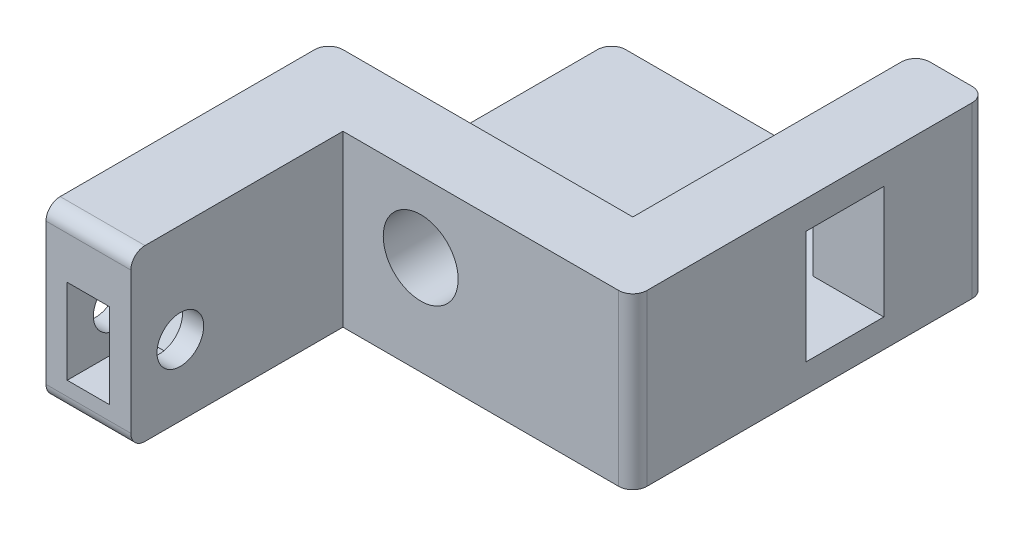
ISO-10303-21;
HEADER;
FILE_DESCRIPTION(('STEP AP214'),'2;1');
FILE_NAME('part.step','',(''),(''),'','','');
FILE_SCHEMA(('AUTOMOTIVE_DESIGN { 1 0 10303 214 1 1 1 1 }'));
ENDSEC;
DATA;
#1=APPLICATION_CONTEXT('core data for automotive mechanical design processes');
#2=APPLICATION_PROTOCOL_DEFINITION('international standard','automotive_design',2000,#1);
#3=PRODUCT_CONTEXT('',#1,'mechanical');
#4=PRODUCT('Part','Part','',(#3));
#5=PRODUCT_RELATED_PRODUCT_CATEGORY('part','',(#4));
#6=PRODUCT_DEFINITION_FORMATION('','',#4);
#7=PRODUCT_DEFINITION_CONTEXT('part definition',#1,'design');
#8=PRODUCT_DEFINITION('design','',#6,#7);
#9=PRODUCT_DEFINITION_SHAPE('','',#8);
#10=(LENGTH_UNIT() NAMED_UNIT(*) SI_UNIT(.MILLI.,.METRE.));
#11=(NAMED_UNIT(*) PLANE_ANGLE_UNIT() SI_UNIT($,.RADIAN.));
#12=(NAMED_UNIT(*) SI_UNIT($,.STERADIAN.) SOLID_ANGLE_UNIT());
#13=UNCERTAINTY_MEASURE_WITH_UNIT(LENGTH_MEASURE(1.E-05),#10,'distance_accuracy_value','');
#14=(GEOMETRIC_REPRESENTATION_CONTEXT(3) GLOBAL_UNCERTAINTY_ASSIGNED_CONTEXT((#13)) GLOBAL_UNIT_ASSIGNED_CONTEXT((#10,
#11,#12)) REPRESENTATION_CONTEXT('',''));
#15=CARTESIAN_POINT('',(0.,0.,0.));
#16=DIRECTION('',(0.,0.,1.));
#17=DIRECTION('',(1.,0.,0.));
#18=AXIS2_PLACEMENT_3D('',#15,#16,#17);
#19=CARTESIAN_POINT('',(0.,10.,60.));
#20=DIRECTION('',(0.,0.,1.));
#21=DIRECTION('',(-1.,0.,0.));
#22=AXIS2_PLACEMENT_3D('',#19,#20,#21);
#23=PLANE('',#22);
#24=DIRECTION('',(0.,-1.,0.));
#25=VECTOR('',#24,1.);
#26=CARTESIAN_POINT('',(6.,10.,60.));
#27=LINE('',#26,#25);
#28=CARTESIAN_POINT('',(6.,9.,60.));
#29=VERTEX_POINT('',#28);
#30=CARTESIAN_POINT('',(6.,-0.999999999999999,60.));
#31=VERTEX_POINT('',#30);
#32=EDGE_CURVE('E338',#29,#31,#27,.T.);
#33=ORIENTED_EDGE('',*,*,#32,.F.);
#34=DIRECTION('',(1.,0.,0.));
#35=VECTOR('',#34,1.);
#36=CARTESIAN_POINT('',(6.,9.,60.));
#37=LINE('',#36,#35);
#38=CARTESIAN_POINT('',(0.,9.,60.));
#39=VERTEX_POINT('',#38);
#40=EDGE_CURVE('E416',#39,#29,#37,.T.);
#41=ORIENTED_EDGE('',*,*,#40,.F.);
#42=DIRECTION('',(0.,-1.,0.));
#43=VECTOR('',#42,1.);
#44=CARTESIAN_POINT('',(0.,10.,60.));
#45=LINE('',#44,#43);
#46=CARTESIAN_POINT('',(0.,-0.999999999999999,60.));
#47=VERTEX_POINT('',#46);
#48=EDGE_CURVE('E325',#39,#47,#45,.T.);
#49=ORIENTED_EDGE('',*,*,#48,.T.);
#50=DIRECTION('',(1.,0.,0.));
#51=VECTOR('',#50,1.);
#52=CARTESIAN_POINT('',(0.,-0.999999999999999,60.));
#53=LINE('',#52,#51);
#54=EDGE_CURVE('E418',#31,#47,#53,.F.);
#55=ORIENTED_EDGE('',*,*,#54,.F.);
#56=EDGE_LOOP('',(#33,#41,#49,#55));
#57=FACE_BOUND('',#56,.T.);
#58=DIRECTION('',(-1.,0.,0.));
#59=VECTOR('',#58,1.);
#60=CARTESIAN_POINT('',(4.5,0.,60.));
#61=LINE('',#60,#59);
#62=CARTESIAN_POINT('',(4.5,0.,60.));
#63=VERTEX_POINT('',#62);
#64=CARTESIAN_POINT('',(1.5,0.,60.));
#65=VERTEX_POINT('',#64);
#66=EDGE_CURVE('E229',#63,#65,#61,.T.);
#67=ORIENTED_EDGE('',*,*,#66,.T.);
#68=DIRECTION('',(0.,1.,0.));
#69=VECTOR('',#68,1.);
#70=CARTESIAN_POINT('',(1.5,0.,60.));
#71=LINE('',#70,#69);
#72=CARTESIAN_POINT('',(1.5,6.,60.));
#73=VERTEX_POINT('',#72);
#74=EDGE_CURVE('E232',#65,#73,#71,.T.);
#75=ORIENTED_EDGE('',*,*,#74,.T.);
#76=DIRECTION('',(-1.,0.,0.));
#77=VECTOR('',#76,1.);
#78=CARTESIAN_POINT('',(4.5,6.,60.));
#79=LINE('',#78,#77);
#80=CARTESIAN_POINT('',(4.5,6.,60.));
#81=VERTEX_POINT('',#80);
#82=EDGE_CURVE('E250',#81,#73,#79,.T.);
#83=ORIENTED_EDGE('',*,*,#82,.F.);
#84=DIRECTION('',(0.,1.,0.));
#85=VECTOR('',#84,1.);
#86=CARTESIAN_POINT('',(4.5,0.,60.));
#87=LINE('',#86,#85);
#88=EDGE_CURVE('E214',#63,#81,#87,.T.);
#89=ORIENTED_EDGE('',*,*,#88,.F.);
#90=EDGE_LOOP('',(#67,#75,#83,#89));
#91=FACE_BOUND('',#90,.T.);
#92=ADVANCED_FACE('F34',(#57,#91),#23,.T.);
#93=CARTESIAN_POINT('',(-4.,3.,56.5));
#94=DIRECTION('',(1.,0.,0.));
#95=DIRECTION('',(0.,0.,1.));
#96=AXIS2_PLACEMENT_3D('',#93,#94,#95);
#97=CYLINDRICAL_SURFACE('',#96,1.65);
#98=CARTESIAN_POINT('',(6.,3.,56.5));
#99=DIRECTION('',(-1.,0.,0.));
#100=DIRECTION('',(0.,0.,1.));
#101=AXIS2_PLACEMENT_3D('',#98,#99,#100);
#102=CIRCLE('',#101,1.65);
#103=CARTESIAN_POINT('',(6.,3.,58.15));
#104=VERTEX_POINT('',#103);
#105=EDGE_CURVE('E263',#104,#104,#102,.T.);
#106=ORIENTED_EDGE('',*,*,#105,.F.);
#107=EDGE_LOOP('',(#106));
#108=FACE_BOUND('',#107,.T.);
#109=CARTESIAN_POINT('',(4.5,3.,56.5));
#110=DIRECTION('',(1.,0.,0.));
#111=DIRECTION('',(0.,0.,-1.));
#112=AXIS2_PLACEMENT_3D('',#109,#110,#111);
#113=CIRCLE('',#112,1.65);
#114=CARTESIAN_POINT('',(4.5,3.,54.85));
#115=VERTEX_POINT('',#114);
#116=EDGE_CURVE('E260',#115,#115,#113,.F.);
#117=ORIENTED_EDGE('',*,*,#116,.T.);
#118=EDGE_LOOP('',(#117));
#119=FACE_BOUND('',#118,.T.);
#120=ADVANCED_FACE('F481',(#108,#119),#97,.F.);
#121=CARTESIAN_POINT('',(21.5,10.,40.));
#122=DIRECTION('',(0.,0.,-1.));
#123=DIRECTION('',(1.,0.,0.));
#124=AXIS2_PLACEMENT_3D('',#121,#122,#123);
#125=PLANE('',#124);
#126=CARTESIAN_POINT('',(11.5,5.,40.));
#127=DIRECTION('',(0.,0.,1.));
#128=DIRECTION('',(1.,0.,0.));
#129=AXIS2_PLACEMENT_3D('',#126,#127,#128);
#130=CIRCLE('',#129,2.65);
#131=CARTESIAN_POINT('',(14.15,5.,40.));
#132=VERTEX_POINT('',#131);
#133=EDGE_CURVE('E259',#132,#132,#130,.T.);
#134=ORIENTED_EDGE('',*,*,#133,.T.);
#135=EDGE_LOOP('',(#134));
#136=FACE_BOUND('',#135,.T.);
#137=DIRECTION('',(-1.,0.,0.));
#138=VECTOR('',#137,1.);
#139=CARTESIAN_POINT('',(21.5,10.,40.));
#140=LINE('',#139,#138);
#141=CARTESIAN_POINT('',(21.5,10.,40.));
#142=VERTEX_POINT('',#141);
#143=CARTESIAN_POINT('',(1.,10.,40.));
#144=VERTEX_POINT('',#143);
#145=EDGE_CURVE('E305',#142,#144,#140,.T.);
#146=ORIENTED_EDGE('',*,*,#145,.F.);
#147=DIRECTION('',(0.,-1.,0.));
#148=VECTOR('',#147,1.);
#149=CARTESIAN_POINT('',(21.5,10.,40.));
#150=LINE('',#149,#148);
#151=CARTESIAN_POINT('',(21.5,0.,40.));
#152=VERTEX_POINT('',#151);
#153=EDGE_CURVE('E331',#142,#152,#150,.T.);
#154=ORIENTED_EDGE('',*,*,#153,.T.);
#155=DIRECTION('',(-1.,0.,0.));
#156=VECTOR('',#155,1.);
#157=CARTESIAN_POINT('',(21.5,0.,40.));
#158=LINE('',#157,#156);
#159=CARTESIAN_POINT('',(1.,0.,40.));
#160=VERTEX_POINT('',#159);
#161=EDGE_CURVE('E300',#152,#160,#158,.T.);
#162=ORIENTED_EDGE('',*,*,#161,.T.);
#163=DIRECTION('',(0.,-1.,0.));
#164=VECTOR('',#163,1.);
#165=CARTESIAN_POINT('',(1.,10.,40.));
#166=LINE('',#165,#164);
#167=EDGE_CURVE('E411',#144,#160,#166,.T.);
#168=ORIENTED_EDGE('',*,*,#167,.F.);
#169=EDGE_LOOP('',(#146,#154,#162,#168));
#170=FACE_BOUND('',#169,.T.);
#171=ADVANCED_FACE('F449',(#136,#170),#125,.T.);
#172=CARTESIAN_POINT('',(21.5,10.,20.));
#173=DIRECTION('',(-1.,0.,0.));
#174=DIRECTION('',(0.,0.,-1.));
#175=AXIS2_PLACEMENT_3D('',#172,#173,#174);
#176=PLANE('',#175);
#177=DIRECTION('',(0.,0.,1.));
#178=VECTOR('',#177,1.);
#179=CARTESIAN_POINT('',(21.5,0.,20.));
#180=LINE('',#179,#178);
#181=CARTESIAN_POINT('',(21.5,0.,21.));
#182=VERTEX_POINT('',#181);
#183=CARTESIAN_POINT('',(21.5,0.,27.25));
#184=VERTEX_POINT('',#183);
#185=EDGE_CURVE('E309',#182,#184,#180,.T.);
#186=ORIENTED_EDGE('',*,*,#185,.T.);
#187=DIRECTION('',(0.,1.,0.));
#188=VECTOR('',#187,1.);
#189=CARTESIAN_POINT('',(21.5,0.,27.25));
#190=LINE('',#189,#188);
#191=CARTESIAN_POINT('',(21.5,8.,27.25));
#192=VERTEX_POINT('',#191);
#193=EDGE_CURVE('E270',#184,#192,#190,.T.);
#194=ORIENTED_EDGE('',*,*,#193,.T.);
#195=DIRECTION('',(0.,0.,1.));
#196=VECTOR('',#195,1.);
#197=CARTESIAN_POINT('',(21.5,8.,32.75));
#198=LINE('',#197,#196);
#199=CARTESIAN_POINT('',(21.5,8.,32.75));
#200=VERTEX_POINT('',#199);
#201=EDGE_CURVE('E273',#192,#200,#198,.T.);
#202=ORIENTED_EDGE('',*,*,#201,.T.);
#203=DIRECTION('',(0.,-1.,0.));
#204=VECTOR('',#203,1.);
#205=CARTESIAN_POINT('',(21.5,0.,32.75));
#206=LINE('',#205,#204);
#207=CARTESIAN_POINT('',(21.5,0.,32.75));
#208=VERTEX_POINT('',#207);
#209=EDGE_CURVE('E267',#200,#208,#206,.T.);
#210=ORIENTED_EDGE('',*,*,#209,.T.);
#211=EDGE_CURVE('E328',#208,#152,#180,.T.);
#212=ORIENTED_EDGE('',*,*,#211,.T.);
#213=ORIENTED_EDGE('',*,*,#153,.F.);
#214=DIRECTION('',(0.,0.,1.));
#215=VECTOR('',#214,1.);
#216=CARTESIAN_POINT('',(21.5,10.,20.));
#217=LINE('',#216,#215);
#218=CARTESIAN_POINT('',(21.5,10.,21.));
#219=VERTEX_POINT('',#218);
#220=EDGE_CURVE('E323',#219,#142,#217,.T.);
#221=ORIENTED_EDGE('',*,*,#220,.F.);
#222=DIRECTION('',(0.,-1.,0.));
#223=VECTOR('',#222,1.);
#224=CARTESIAN_POINT('',(21.5,10.,21.));
#225=LINE('',#224,#223);
#226=EDGE_CURVE('E389',#182,#219,#225,.F.);
#227=ORIENTED_EDGE('',*,*,#226,.F.);
#228=EDGE_LOOP('',(#186,#194,#202,#210,#212,#213,#221,#227));
#229=FACE_BOUND('',#228,.T.);
#230=ADVANCED_FACE('F428',(#229),#176,.T.);
#231=CARTESIAN_POINT('',(26.5,10.,20.));
#232=DIRECTION('',(0.,0.,-1.));
#233=DIRECTION('',(1.,0.,0.));
#234=AXIS2_PLACEMENT_3D('',#231,#232,#233);
#235=PLANE('',#234);
#236=DIRECTION('',(-1.,0.,0.));
#237=VECTOR('',#236,1.);
#238=CARTESIAN_POINT('',(26.5,0.,20.));
#239=LINE('',#238,#237);
#240=CARTESIAN_POINT('',(22.5,0.,20.));
#241=VERTEX_POINT('',#240);
#242=CARTESIAN_POINT('',(1.,0.,20.));
#243=VERTEX_POINT('',#242);
#244=EDGE_CURVE('E279',#241,#243,#239,.T.);
#245=ORIENTED_EDGE('',*,*,#244,.F.);
#246=DIRECTION('',(0.,-1.,0.));
#247=VECTOR('',#246,1.);
#248=CARTESIAN_POINT('',(22.5,10.,20.));
#249=LINE('',#248,#247);
#250=CARTESIAN_POINT('',(22.5,10.,20.));
#251=VERTEX_POINT('',#250);
#252=EDGE_CURVE('E375',#251,#241,#249,.T.);
#253=ORIENTED_EDGE('',*,*,#252,.F.);
#254=DIRECTION('',(-1.,0.,0.));
#255=VECTOR('',#254,1.);
#256=CARTESIAN_POINT('',(26.5,10.,20.));
#257=LINE('',#256,#255);
#258=CARTESIAN_POINT('',(25.5,10.,20.));
#259=VERTEX_POINT('',#258);
#260=EDGE_CURVE('E320',#259,#251,#257,.T.);
#261=ORIENTED_EDGE('',*,*,#260,.F.);
#262=DIRECTION('',(0.,-1.,0.));
#263=VECTOR('',#262,1.);
#264=CARTESIAN_POINT('',(25.5,10.,20.));
#265=LINE('',#264,#263);
#266=CARTESIAN_POINT('',(25.5,-2.,20.));
#267=VERTEX_POINT('',#266);
#268=EDGE_CURVE('E372',#267,#259,#265,.F.);
#269=ORIENTED_EDGE('',*,*,#268,.F.);
#270=DIRECTION('',(-1.,0.,0.));
#271=VECTOR('',#270,1.);
#272=CARTESIAN_POINT('',(26.5,-2.,20.));
#273=LINE('',#272,#271);
#274=CARTESIAN_POINT('',(1.,-2.,20.));
#275=VERTEX_POINT('',#274);
#276=EDGE_CURVE('E288',#267,#275,#273,.T.);
#277=ORIENTED_EDGE('',*,*,#276,.T.);
#278=DIRECTION('',(0.,1.,0.));
#279=VECTOR('',#278,1.);
#280=CARTESIAN_POINT('',(1.,10.,20.));
#281=LINE('',#280,#279);
#282=EDGE_CURVE('E378',#243,#275,#281,.F.);
#283=ORIENTED_EDGE('',*,*,#282,.F.);
#284=EDGE_LOOP('',(#245,#253,#261,#269,#277,#283));
#285=FACE_BOUND('',#284,.T.);
#286=ADVANCED_FACE('F455',(#285),#235,.T.);
#287=CARTESIAN_POINT('',(26.5,10.,45.));
#288=DIRECTION('',(1.,0.,0.));
#289=DIRECTION('',(0.,0.,1.));
#290=AXIS2_PLACEMENT_3D('',#287,#288,#289);
#291=PLANE('',#290);
#292=DIRECTION('',(0.,1.,0.));
#293=VECTOR('',#292,1.);
#294=CARTESIAN_POINT('',(26.5,10.,32.75));
#295=LINE('',#294,#293);
#296=CARTESIAN_POINT('',(26.5,0.,32.75));
#297=VERTEX_POINT('',#296);
#298=CARTESIAN_POINT('',(26.5,8.,32.75));
#299=VERTEX_POINT('',#298);
#300=EDGE_CURVE('E350',#297,#299,#295,.T.);
#301=ORIENTED_EDGE('',*,*,#300,.T.);
#302=DIRECTION('',(0.,0.,-1.));
#303=VECTOR('',#302,1.);
#304=CARTESIAN_POINT('',(26.5,8.,45.));
#305=LINE('',#304,#303);
#306=CARTESIAN_POINT('',(26.5,8.,27.25));
#307=VERTEX_POINT('',#306);
#308=EDGE_CURVE('E347',#299,#307,#305,.T.);
#309=ORIENTED_EDGE('',*,*,#308,.T.);
#310=DIRECTION('',(0.,-1.,0.));
#311=VECTOR('',#310,1.);
#312=CARTESIAN_POINT('',(26.5,10.,27.25));
#313=LINE('',#312,#311);
#314=CARTESIAN_POINT('',(26.5,0.,27.25));
#315=VERTEX_POINT('',#314);
#316=EDGE_CURVE('E344',#307,#315,#313,.T.);
#317=ORIENTED_EDGE('',*,*,#316,.T.);
#318=DIRECTION('',(0.,0.,1.));
#319=VECTOR('',#318,1.);
#320=CARTESIAN_POINT('',(26.5,0.,45.));
#321=LINE('',#320,#319);
#322=EDGE_CURVE('E334',#315,#297,#321,.T.);
#323=ORIENTED_EDGE('',*,*,#322,.T.);
#324=EDGE_LOOP('',(#301,#309,#317,#323));
#325=FACE_BOUND('',#324,.T.);
#326=DIRECTION('',(0.,0.,-1.));
#327=VECTOR('',#326,1.);
#328=CARTESIAN_POINT('',(26.5,10.,45.));
#329=LINE('',#328,#327);
#330=CARTESIAN_POINT('',(26.5,10.,44.));
#331=VERTEX_POINT('',#330);
#332=CARTESIAN_POINT('',(26.5,10.,21.));
#333=VERTEX_POINT('',#332);
#334=EDGE_CURVE('E317',#331,#333,#329,.T.);
#335=ORIENTED_EDGE('',*,*,#334,.F.);
#336=DIRECTION('',(0.,-1.,0.));
#337=VECTOR('',#336,1.);
#338=CARTESIAN_POINT('',(26.5,10.,44.));
#339=LINE('',#338,#337);
#340=CARTESIAN_POINT('',(26.5,-2.,44.));
#341=VERTEX_POINT('',#340);
#342=EDGE_CURVE('E402',#341,#331,#339,.F.);
#343=ORIENTED_EDGE('',*,*,#342,.F.);
#344=DIRECTION('',(0.,0.,-1.));
#345=VECTOR('',#344,1.);
#346=CARTESIAN_POINT('',(26.5,-2.,45.));
#347=LINE('',#346,#345);
#348=CARTESIAN_POINT('',(26.5,-2.,21.));
#349=VERTEX_POINT('',#348);
#350=EDGE_CURVE('E285',#341,#349,#347,.T.);
#351=ORIENTED_EDGE('',*,*,#350,.T.);
#352=DIRECTION('',(0.,-1.,0.));
#353=VECTOR('',#352,1.);
#354=CARTESIAN_POINT('',(26.5,10.,21.));
#355=LINE('',#354,#353);
#356=EDGE_CURVE('E405',#333,#349,#355,.T.);
#357=ORIENTED_EDGE('',*,*,#356,.F.);
#358=EDGE_LOOP('',(#335,#343,#351,#357));
#359=FACE_BOUND('',#358,.T.);
#360=ADVANCED_FACE('F513',(#325,#359),#291,.T.);
#361=CARTESIAN_POINT('',(6.,10.,45.));
#362=DIRECTION('',(0.,0.,1.));
#363=DIRECTION('',(-1.,0.,0.));
#364=AXIS2_PLACEMENT_3D('',#361,#362,#363);
#365=PLANE('',#364);
#366=CARTESIAN_POINT('',(11.5,5.,45.));
#367=DIRECTION('',(0.,0.,-1.));
#368=DIRECTION('',(-1.,0.,0.));
#369=AXIS2_PLACEMENT_3D('',#366,#367,#368);
#370=CIRCLE('',#369,2.65);
#371=CARTESIAN_POINT('',(8.85,5.,45.));
#372=VERTEX_POINT('',#371);
#373=EDGE_CURVE('E256',#372,#372,#370,.T.);
#374=ORIENTED_EDGE('',*,*,#373,.T.);
#375=EDGE_LOOP('',(#374));
#376=FACE_BOUND('',#375,.T.);
#377=DIRECTION('',(1.,0.,0.));
#378=VECTOR('',#377,1.);
#379=CARTESIAN_POINT('',(6.,10.,45.));
#380=LINE('',#379,#378);
#381=CARTESIAN_POINT('',(6.,10.,45.));
#382=VERTEX_POINT('',#381);
#383=CARTESIAN_POINT('',(25.5,10.,45.));
#384=VERTEX_POINT('',#383);
#385=EDGE_CURVE('E314',#382,#384,#380,.T.);
#386=ORIENTED_EDGE('',*,*,#385,.F.);
#387=DIRECTION('',(0.,-1.,0.));
#388=VECTOR('',#387,1.);
#389=CARTESIAN_POINT('',(6.,10.,45.));
#390=LINE('',#389,#388);
#391=CARTESIAN_POINT('',(6.,-2.,45.));
#392=VERTEX_POINT('',#391);
#393=EDGE_CURVE('E335',#382,#392,#390,.T.);
#394=ORIENTED_EDGE('',*,*,#393,.T.);
#395=DIRECTION('',(1.,0.,0.));
#396=VECTOR('',#395,1.);
#397=CARTESIAN_POINT('',(26.5,-2.,45.));
#398=LINE('',#397,#396);
#399=CARTESIAN_POINT('',(25.5,-2.,45.));
#400=VERTEX_POINT('',#399);
#401=EDGE_CURVE('E297',#392,#400,#398,.T.);
#402=ORIENTED_EDGE('',*,*,#401,.T.);
#403=DIRECTION('',(0.,-1.,0.));
#404=VECTOR('',#403,1.);
#405=CARTESIAN_POINT('',(25.5,10.,45.));
#406=LINE('',#405,#404);
#407=EDGE_CURVE('E408',#384,#400,#406,.T.);
#408=ORIENTED_EDGE('',*,*,#407,.F.);
#409=EDGE_LOOP('',(#386,#394,#402,#408));
#410=FACE_BOUND('',#409,.T.);
#411=ADVANCED_FACE('F528',(#376,#410),#365,.T.);
#412=CARTESIAN_POINT('',(6.,10.,60.));
#413=DIRECTION('',(1.,0.,0.));
#414=DIRECTION('',(0.,0.,1.));
#415=AXIS2_PLACEMENT_3D('',#412,#413,#414);
#416=PLANE('',#415);
#417=ORIENTED_EDGE('',*,*,#105,.T.);
#418=EDGE_LOOP('',(#417));
#419=FACE_BOUND('',#418,.T.);
#420=DIRECTION('',(0.,0.,-1.));
#421=VECTOR('',#420,1.);
#422=CARTESIAN_POINT('',(6.,-2.,60.));
#423=LINE('',#422,#421);
#424=CARTESIAN_POINT('',(6.,-2.,59.));
#425=VERTEX_POINT('',#424);
#426=EDGE_CURVE('E295',#425,#392,#423,.T.);
#427=ORIENTED_EDGE('',*,*,#426,.T.);
#428=ORIENTED_EDGE('',*,*,#393,.F.);
#429=DIRECTION('',(0.,0.,-1.));
#430=VECTOR('',#429,1.);
#431=CARTESIAN_POINT('',(6.,10.,60.));
#432=LINE('',#431,#430);
#433=CARTESIAN_POINT('',(6.,10.,59.));
#434=VERTEX_POINT('',#433);
#435=EDGE_CURVE('E312',#434,#382,#432,.T.);
#436=ORIENTED_EDGE('',*,*,#435,.F.);
#437=CARTESIAN_POINT('',(6.,9.,59.));
#438=DIRECTION('',(-1.,0.,0.));
#439=DIRECTION('',(0.,0.,1.));
#440=AXIS2_PLACEMENT_3D('',#437,#438,#439);
#441=CIRCLE('',#440,1.);
#442=EDGE_CURVE('E57',#29,#434,#441,.T.);
#443=ORIENTED_EDGE('',*,*,#442,.F.);
#444=ORIENTED_EDGE('',*,*,#32,.T.);
#445=CARTESIAN_POINT('',(6.,-1.,59.));
#446=DIRECTION('',(-1.,0.,0.));
#447=DIRECTION('',(0.,0.,1.));
#448=AXIS2_PLACEMENT_3D('',#445,#446,#447);
#449=CIRCLE('',#448,1.);
#450=EDGE_CURVE('E49',#425,#31,#449,.T.);
#451=ORIENTED_EDGE('',*,*,#450,.F.);
#452=EDGE_LOOP('',(#427,#428,#436,#443,#444,#451));
#453=FACE_BOUND('',#452,.T.);
#454=ADVANCED_FACE('F494',(#419,#453),#416,.T.);
#455=CARTESIAN_POINT('',(0.,10.,40.));
#456=DIRECTION('',(-1.,0.,0.));
#457=DIRECTION('',(0.,0.,-1.));
#458=AXIS2_PLACEMENT_3D('',#455,#456,#457);
#459=PLANE('',#458);
#460=CARTESIAN_POINT('',(0.,3.,56.5));
#461=DIRECTION('',(1.,0.,0.));
#462=DIRECTION('',(0.,0.,-1.));
#463=AXIS2_PLACEMENT_3D('',#460,#461,#462);
#464=CIRCLE('',#463,1.65);
#465=CARTESIAN_POINT('',(0.,3.,54.85));
#466=VERTEX_POINT('',#465);
#467=EDGE_CURVE('E266',#466,#466,#464,.T.);
#468=ORIENTED_EDGE('',*,*,#467,.T.);
#469=EDGE_LOOP('',(#468));
#470=FACE_BOUND('',#469,.T.);
#471=DIRECTION('',(0.,0.,1.));
#472=VECTOR('',#471,1.);
#473=CARTESIAN_POINT('',(0.,-2.,60.));
#474=LINE('',#473,#472);
#475=CARTESIAN_POINT('',(0.,-2.,21.));
#476=VERTEX_POINT('',#475);
#477=CARTESIAN_POINT('',(0.,-2.,59.));
#478=VERTEX_POINT('',#477);
#479=EDGE_CURVE('E292',#476,#478,#474,.T.);
#480=ORIENTED_EDGE('',*,*,#479,.T.);
#481=CARTESIAN_POINT('',(0.,-1.,59.));
#482=DIRECTION('',(1.,0.,0.));
#483=DIRECTION('',(0.,0.,-1.));
#484=AXIS2_PLACEMENT_3D('',#481,#482,#483);
#485=CIRCLE('',#484,1.);
#486=EDGE_CURVE('E361',#47,#478,#485,.T.);
#487=ORIENTED_EDGE('',*,*,#486,.F.);
#488=ORIENTED_EDGE('',*,*,#48,.F.);
#489=CARTESIAN_POINT('',(0.,9.,59.));
#490=DIRECTION('',(1.,0.,0.));
#491=DIRECTION('',(0.,0.,-1.));
#492=AXIS2_PLACEMENT_3D('',#489,#490,#491);
#493=CIRCLE('',#492,1.);
#494=CARTESIAN_POINT('',(0.,10.,59.));
#495=VERTEX_POINT('',#494);
#496=EDGE_CURVE('E353',#495,#39,#493,.T.);
#497=ORIENTED_EDGE('',*,*,#496,.F.);
#498=DIRECTION('',(0.,0.,1.));
#499=VECTOR('',#498,1.);
#500=CARTESIAN_POINT('',(0.,10.,40.));
#501=LINE('',#500,#499);
#502=CARTESIAN_POINT('',(0.,10.,41.));
#503=VERTEX_POINT('',#502);
#504=EDGE_CURVE('E308',#503,#495,#501,.T.);
#505=ORIENTED_EDGE('',*,*,#504,.F.);
#506=DIRECTION('',(0.,-1.,0.));
#507=VECTOR('',#506,1.);
#508=CARTESIAN_POINT('',(0.,10.,41.));
#509=LINE('',#508,#507);
#510=CARTESIAN_POINT('',(0.,0.,41.));
#511=VERTEX_POINT('',#510);
#512=EDGE_CURVE('E364',#511,#503,#509,.F.);
#513=ORIENTED_EDGE('',*,*,#512,.F.);
#514=DIRECTION('',(0.,0.,1.));
#515=VECTOR('',#514,1.);
#516=CARTESIAN_POINT('',(0.,0.,60.));
#517=LINE('',#516,#515);
#518=CARTESIAN_POINT('',(0.,0.,21.));
#519=VERTEX_POINT('',#518);
#520=EDGE_CURVE('E289',#519,#511,#517,.T.);
#521=ORIENTED_EDGE('',*,*,#520,.F.);
#522=DIRECTION('',(0.,1.,0.));
#523=VECTOR('',#522,1.);
#524=CARTESIAN_POINT('',(0.,10.,21.));
#525=LINE('',#524,#523);
#526=EDGE_CURVE('E367',#476,#519,#525,.T.);
#527=ORIENTED_EDGE('',*,*,#526,.F.);
#528=EDGE_LOOP('',(#480,#487,#488,#497,#505,#513,#521,#527));
#529=FACE_BOUND('',#528,.T.);
#530=ADVANCED_FACE('F464',(#470,#529),#459,.T.);
#531=CARTESIAN_POINT('',(0.,10.,40.));
#532=DIRECTION('',(0.,-1.,0.));
#533=DIRECTION('',(0.,0.,1.));
#534=AXIS2_PLACEMENT_3D('',#531,#532,#533);
#535=PLANE('',#534);
#536=ORIENTED_EDGE('',*,*,#220,.T.);
#537=ORIENTED_EDGE('',*,*,#145,.T.);
#538=CARTESIAN_POINT('',(1.,10.,41.));
#539=DIRECTION('',(0.,1.,0.));
#540=DIRECTION('',(0.,0.,1.));
#541=AXIS2_PLACEMENT_3D('',#538,#539,#540);
#542=CIRCLE('',#541,1.);
#543=EDGE_CURVE('E394',#503,#144,#542,.F.);
#544=ORIENTED_EDGE('',*,*,#543,.F.);
#545=ORIENTED_EDGE('',*,*,#504,.T.);
#546=DIRECTION('',(1.,0.,0.));
#547=VECTOR('',#546,1.);
#548=CARTESIAN_POINT('',(0.,10.,59.));
#549=LINE('',#548,#547);
#550=EDGE_CURVE('E392',#434,#495,#549,.F.);
#551=ORIENTED_EDGE('',*,*,#550,.F.);
#552=ORIENTED_EDGE('',*,*,#435,.T.);
#553=ORIENTED_EDGE('',*,*,#385,.T.);
#554=CARTESIAN_POINT('',(25.5,10.,44.));
#555=DIRECTION('',(0.,1.,0.));
#556=DIRECTION('',(0.,0.,1.));
#557=AXIS2_PLACEMENT_3D('',#554,#555,#556);
#558=CIRCLE('',#557,1.);
#559=EDGE_CURVE('E396',#331,#384,#558,.F.);
#560=ORIENTED_EDGE('',*,*,#559,.F.);
#561=ORIENTED_EDGE('',*,*,#334,.T.);
#562=CARTESIAN_POINT('',(25.5,10.,21.));
#563=DIRECTION('',(0.,1.,0.));
#564=DIRECTION('',(0.,0.,1.));
#565=AXIS2_PLACEMENT_3D('',#562,#563,#564);
#566=CIRCLE('',#565,1.);
#567=EDGE_CURVE('E398',#259,#333,#566,.F.);
#568=ORIENTED_EDGE('',*,*,#567,.F.);
#569=ORIENTED_EDGE('',*,*,#260,.T.);
#570=CARTESIAN_POINT('',(22.5,10.,21.));
#571=DIRECTION('',(0.,1.,0.));
#572=DIRECTION('',(0.,0.,1.));
#573=AXIS2_PLACEMENT_3D('',#570,#571,#572);
#574=CIRCLE('',#573,1.);
#575=EDGE_CURVE('E400',#219,#251,#574,.F.);
#576=ORIENTED_EDGE('',*,*,#575,.F.);
#577=EDGE_LOOP('',(#536,#537,#544,#545,#551,#552,#553,#560,#561,#568,#569,#576));
#578=FACE_BOUND('',#577,.T.);
#579=ADVANCED_FACE('F451',(#578),#535,.F.);
#580=CARTESIAN_POINT('',(0.,0.,40.));
#581=DIRECTION('',(0.,-1.,0.));
#582=DIRECTION('',(0.,0.,1.));
#583=AXIS2_PLACEMENT_3D('',#580,#581,#582);
#584=PLANE('',#583);
#585=ORIENTED_EDGE('',*,*,#520,.T.);
#586=CARTESIAN_POINT('',(1.,0.,41.));
#587=DIRECTION('',(0.,1.,0.));
#588=DIRECTION('',(0.,0.,1.));
#589=AXIS2_PLACEMENT_3D('',#586,#587,#588);
#590=CIRCLE('',#589,1.);
#591=EDGE_CURVE('E11',#160,#511,#590,.T.);
#592=ORIENTED_EDGE('',*,*,#591,.F.);
#593=ORIENTED_EDGE('',*,*,#161,.F.);
#594=ORIENTED_EDGE('',*,*,#211,.F.);
#595=DIRECTION('',(-1.,0.,0.));
#596=VECTOR('',#595,1.);
#597=CARTESIAN_POINT('',(31.5,0.,32.75));
#598=LINE('',#597,#596);
#599=EDGE_CURVE('E276',#297,#208,#598,.T.);
#600=ORIENTED_EDGE('',*,*,#599,.F.);
#601=ORIENTED_EDGE('',*,*,#322,.F.);
#602=DIRECTION('',(-1.,0.,0.));
#603=VECTOR('',#602,1.);
#604=CARTESIAN_POINT('',(31.5,0.,27.25));
#605=LINE('',#604,#603);
#606=EDGE_CURVE('E282',#315,#184,#605,.T.);
#607=ORIENTED_EDGE('',*,*,#606,.T.);
#608=ORIENTED_EDGE('',*,*,#185,.F.);
#609=CARTESIAN_POINT('',(22.5,0.,21.));
#610=DIRECTION('',(0.,1.,0.));
#611=DIRECTION('',(0.,0.,1.));
#612=AXIS2_PLACEMENT_3D('',#609,#610,#611);
#613=CIRCLE('',#612,1.);
#614=EDGE_CURVE('E42',#241,#182,#613,.T.);
#615=ORIENTED_EDGE('',*,*,#614,.F.);
#616=ORIENTED_EDGE('',*,*,#244,.T.);
#617=CARTESIAN_POINT('',(1.,0.,21.));
#618=DIRECTION('',(0.,1.,0.));
#619=DIRECTION('',(0.,0.,1.));
#620=AXIS2_PLACEMENT_3D('',#617,#618,#619);
#621=CIRCLE('',#620,1.);
#622=EDGE_CURVE('E370',#519,#243,#621,.F.);
#623=ORIENTED_EDGE('',*,*,#622,.F.);
#624=EDGE_LOOP('',(#585,#592,#593,#594,#600,#601,#607,#608,#615,#616,#623));
#625=FACE_BOUND('',#624,.T.);
#626=ADVANCED_FACE('F430',(#625),#584,.F.);
#627=CARTESIAN_POINT('',(0.,-2.,40.));
#628=DIRECTION('',(0.,-1.,0.));
#629=DIRECTION('',(0.,0.,1.));
#630=AXIS2_PLACEMENT_3D('',#627,#628,#629);
#631=PLANE('',#630);
#632=ORIENTED_EDGE('',*,*,#276,.F.);
#633=CARTESIAN_POINT('',(25.5,-2.,21.));
#634=DIRECTION('',(0.,1.,0.));
#635=DIRECTION('',(0.,0.,1.));
#636=AXIS2_PLACEMENT_3D('',#633,#634,#635);
#637=CIRCLE('',#636,1.);
#638=EDGE_CURVE('E385',#349,#267,#637,.T.);
#639=ORIENTED_EDGE('',*,*,#638,.F.);
#640=ORIENTED_EDGE('',*,*,#350,.F.);
#641=CARTESIAN_POINT('',(25.5,-2.,44.));
#642=DIRECTION('',(0.,1.,0.));
#643=DIRECTION('',(0.,0.,1.));
#644=AXIS2_PLACEMENT_3D('',#641,#642,#643);
#645=CIRCLE('',#644,1.);
#646=EDGE_CURVE('E383',#400,#341,#645,.T.);
#647=ORIENTED_EDGE('',*,*,#646,.F.);
#648=ORIENTED_EDGE('',*,*,#401,.F.);
#649=ORIENTED_EDGE('',*,*,#426,.F.);
#650=DIRECTION('',(1.,0.,0.));
#651=VECTOR('',#650,1.);
#652=CARTESIAN_POINT('',(0.,-2.,59.));
#653=LINE('',#652,#651);
#654=EDGE_CURVE('E381',#478,#425,#653,.T.);
#655=ORIENTED_EDGE('',*,*,#654,.F.);
#656=ORIENTED_EDGE('',*,*,#479,.F.);
#657=CARTESIAN_POINT('',(1.,-2.,21.));
#658=DIRECTION('',(0.,1.,0.));
#659=DIRECTION('',(0.,0.,1.));
#660=AXIS2_PLACEMENT_3D('',#657,#658,#659);
#661=CIRCLE('',#660,1.);
#662=EDGE_CURVE('E387',#275,#476,#661,.T.);
#663=ORIENTED_EDGE('',*,*,#662,.F.);
#664=EDGE_LOOP('',(#632,#639,#640,#647,#648,#649,#655,#656,#663));
#665=FACE_BOUND('',#664,.T.);
#666=ADVANCED_FACE('F521',(#665),#631,.T.);
#667=CARTESIAN_POINT('',(31.5,0.,32.75));
#668=DIRECTION('',(0.,0.,1.));
#669=DIRECTION('',(0.,1.,0.));
#670=AXIS2_PLACEMENT_3D('',#667,#668,#669);
#671=PLANE('',#670);
#672=ORIENTED_EDGE('',*,*,#300,.F.);
#673=ORIENTED_EDGE('',*,*,#599,.T.);
#674=ORIENTED_EDGE('',*,*,#209,.F.);
#675=DIRECTION('',(-1.,0.,0.));
#676=VECTOR('',#675,1.);
#677=CARTESIAN_POINT('',(31.5,8.,32.75));
#678=LINE('',#677,#676);
#679=EDGE_CURVE('E277',#299,#200,#678,.T.);
#680=ORIENTED_EDGE('',*,*,#679,.F.);
#681=EDGE_LOOP('',(#672,#673,#674,#680));
#682=FACE_BOUND('',#681,.T.);
#683=ADVANCED_FACE('F443',(#682),#671,.F.);
#684=CARTESIAN_POINT('',(31.5,8.,32.75));
#685=DIRECTION('',(0.,1.,0.));
#686=DIRECTION('',(0.,0.,-1.));
#687=AXIS2_PLACEMENT_3D('',#684,#685,#686);
#688=PLANE('',#687);
#689=ORIENTED_EDGE('',*,*,#308,.F.);
#690=ORIENTED_EDGE('',*,*,#679,.T.);
#691=ORIENTED_EDGE('',*,*,#201,.F.);
#692=DIRECTION('',(-1.,0.,0.));
#693=VECTOR('',#692,1.);
#694=CARTESIAN_POINT('',(31.5,8.,27.25));
#695=LINE('',#694,#693);
#696=EDGE_CURVE('E280',#307,#192,#695,.T.);
#697=ORIENTED_EDGE('',*,*,#696,.F.);
#698=EDGE_LOOP('',(#689,#690,#691,#697));
#699=FACE_BOUND('',#698,.T.);
#700=ADVANCED_FACE('F440',(#699),#688,.F.);
#701=CARTESIAN_POINT('',(31.5,0.,27.25));
#702=DIRECTION('',(0.,0.,-1.));
#703=DIRECTION('',(0.,-1.,0.));
#704=AXIS2_PLACEMENT_3D('',#701,#702,#703);
#705=PLANE('',#704);
#706=ORIENTED_EDGE('',*,*,#316,.F.);
#707=ORIENTED_EDGE('',*,*,#696,.T.);
#708=ORIENTED_EDGE('',*,*,#193,.F.);
#709=ORIENTED_EDGE('',*,*,#606,.F.);
#710=EDGE_LOOP('',(#706,#707,#708,#709));
#711=FACE_BOUND('',#710,.T.);
#712=ADVANCED_FACE('F435',(#711),#705,.F.);
#713=CARTESIAN_POINT('',(1.5,3.,56.5));
#714=DIRECTION('',(1.,0.,0.));
#715=DIRECTION('',(0.,0.,-1.));
#716=AXIS2_PLACEMENT_3D('',#713,#714,#715);
#717=CIRCLE('',#716,1.65);
#718=CARTESIAN_POINT('',(1.5,3.,54.85));
#719=VERTEX_POINT('',#718);
#720=EDGE_CURVE('E249',#719,#719,#717,.F.);
#721=ORIENTED_EDGE('',*,*,#720,.F.);
#722=EDGE_LOOP('',(#721));
#723=FACE_BOUND('',#722,.T.);
#724=ORIENTED_EDGE('',*,*,#467,.F.);
#725=EDGE_LOOP('',(#724));
#726=FACE_BOUND('',#725,.T.);
#727=ADVANCED_FACE('F489',(#723,#726),#97,.F.);
#728=CARTESIAN_POINT('',(11.5,5.,35.));
#729=DIRECTION('',(0.,0.,1.));
#730=DIRECTION('',(-1.,0.,0.));
#731=AXIS2_PLACEMENT_3D('',#728,#729,#730);
#732=CYLINDRICAL_SURFACE('',#731,2.65);
#733=ORIENTED_EDGE('',*,*,#133,.F.);
#734=EDGE_LOOP('',(#733));
#735=FACE_BOUND('',#734,.T.);
#736=ORIENTED_EDGE('',*,*,#373,.F.);
#737=EDGE_LOOP('',(#736));
#738=FACE_BOUND('',#737,.T.);
#739=ADVANCED_FACE('F556',(#735,#738),#732,.F.);
#740=CARTESIAN_POINT('',(4.5,0.,40.));
#741=DIRECTION('',(-1.,0.,0.));
#742=DIRECTION('',(0.,0.,-1.));
#743=AXIS2_PLACEMENT_3D('',#740,#741,#742);
#744=PLANE('',#743);
#745=DIRECTION('',(0.,0.,-1.));
#746=VECTOR('',#745,1.);
#747=CARTESIAN_POINT('',(4.5,0.,58.2320508075689));
#748=LINE('',#747,#746);
#749=CARTESIAN_POINT('',(4.5,0.,54.7679491924311));
#750=VERTEX_POINT('',#749);
#751=EDGE_CURVE('E220',#63,#750,#748,.T.);
#752=ORIENTED_EDGE('',*,*,#751,.F.);
#753=ORIENTED_EDGE('',*,*,#88,.T.);
#754=DIRECTION('',(0.,0.,1.));
#755=VECTOR('',#754,1.);
#756=CARTESIAN_POINT('',(4.5,6.,54.7679491924311));
#757=LINE('',#756,#755);
#758=CARTESIAN_POINT('',(4.5,6.,54.7679491924311));
#759=VERTEX_POINT('',#758);
#760=EDGE_CURVE('E236',#759,#81,#757,.T.);
#761=ORIENTED_EDGE('',*,*,#760,.F.);
#762=DIRECTION('',(0.,0.866025403784438,0.5));
#763=VECTOR('',#762,1.);
#764=CARTESIAN_POINT('',(4.5,3.,53.0358983848623));
#765=LINE('',#764,#763);
#766=CARTESIAN_POINT('',(4.5,3.,53.0358983848623));
#767=VERTEX_POINT('',#766);
#768=EDGE_CURVE('E224',#767,#759,#765,.T.);
#769=ORIENTED_EDGE('',*,*,#768,.F.);
#770=DIRECTION('',(0.,0.866025403784439,-0.499999999999999));
#771=VECTOR('',#770,1.);
#772=CARTESIAN_POINT('',(4.5,0.,54.7679491924311));
#773=LINE('',#772,#771);
#774=EDGE_CURVE('E206',#750,#767,#773,.T.);
#775=ORIENTED_EDGE('',*,*,#774,.F.);
#776=EDGE_LOOP('',(#752,#753,#761,#769,#775));
#777=FACE_BOUND('',#776,.T.);
#778=ORIENTED_EDGE('',*,*,#116,.F.);
#779=EDGE_LOOP('',(#778));
#780=FACE_BOUND('',#779,.T.);
#781=ADVANCED_FACE('F217',(#777,#780),#744,.T.);
#782=CARTESIAN_POINT('',(1.5,0.,40.));
#783=DIRECTION('',(-1.,0.,0.));
#784=DIRECTION('',(0.,0.,-1.));
#785=AXIS2_PLACEMENT_3D('',#782,#783,#784);
#786=PLANE('',#785);
#787=DIRECTION('',(0.,0.,1.));
#788=VECTOR('',#787,1.);
#789=CARTESIAN_POINT('',(1.5,0.,58.2320508075689));
#790=LINE('',#789,#788);
#791=CARTESIAN_POINT('',(1.5,0.,54.7679491924311));
#792=VERTEX_POINT('',#791);
#793=EDGE_CURVE('E230',#792,#65,#790,.T.);
#794=ORIENTED_EDGE('',*,*,#793,.F.);
#795=DIRECTION('',(0.,0.866025403784439,-0.499999999999999));
#796=VECTOR('',#795,1.);
#797=CARTESIAN_POINT('',(1.5,0.,54.7679491924311));
#798=LINE('',#797,#796);
#799=CARTESIAN_POINT('',(1.5,3.,53.0358983848623));
#800=VERTEX_POINT('',#799);
#801=EDGE_CURVE('E209',#792,#800,#798,.T.);
#802=ORIENTED_EDGE('',*,*,#801,.T.);
#803=DIRECTION('',(0.,0.866025403784438,0.5));
#804=VECTOR('',#803,1.);
#805=CARTESIAN_POINT('',(1.5,3.,53.0358983848623));
#806=LINE('',#805,#804);
#807=CARTESIAN_POINT('',(1.5,6.,54.7679491924311));
#808=VERTEX_POINT('',#807);
#809=EDGE_CURVE('E240',#800,#808,#806,.T.);
#810=ORIENTED_EDGE('',*,*,#809,.T.);
#811=DIRECTION('',(0.,0.,-1.));
#812=VECTOR('',#811,1.);
#813=CARTESIAN_POINT('',(1.5,6.,60.));
#814=LINE('',#813,#812);
#815=EDGE_CURVE('E243',#73,#808,#814,.T.);
#816=ORIENTED_EDGE('',*,*,#815,.F.);
#817=ORIENTED_EDGE('',*,*,#74,.F.);
#818=EDGE_LOOP('',(#794,#802,#810,#816,#817));
#819=FACE_BOUND('',#818,.T.);
#820=ORIENTED_EDGE('',*,*,#720,.T.);
#821=EDGE_LOOP('',(#820));
#822=FACE_BOUND('',#821,.T.);
#823=ADVANCED_FACE('F573',(#819,#822),#786,.F.);
#824=CARTESIAN_POINT('',(4.5,0.,58.2320508075689));
#825=DIRECTION('',(0.,1.,0.));
#826=DIRECTION('',(0.,0.,-1.));
#827=AXIS2_PLACEMENT_3D('',#824,#825,#826);
#828=PLANE('',#827);
#829=ORIENTED_EDGE('',*,*,#793,.T.);
#830=ORIENTED_EDGE('',*,*,#66,.F.);
#831=ORIENTED_EDGE('',*,*,#751,.T.);
#832=DIRECTION('',(-1.,0.,0.));
#833=VECTOR('',#832,1.);
#834=CARTESIAN_POINT('',(4.5,0.,54.7679491924311));
#835=LINE('',#834,#833);
#836=EDGE_CURVE('E203',#750,#792,#835,.T.);
#837=ORIENTED_EDGE('',*,*,#836,.T.);
#838=EDGE_LOOP('',(#829,#830,#831,#837));
#839=FACE_BOUND('',#838,.T.);
#840=ADVANCED_FACE('F227',(#839),#828,.T.);
#841=CARTESIAN_POINT('',(4.5,6.,60.));
#842=DIRECTION('',(0.,-1.,0.));
#843=DIRECTION('',(0.,0.,1.));
#844=AXIS2_PLACEMENT_3D('',#841,#842,#843);
#845=PLANE('',#844);
#846=ORIENTED_EDGE('',*,*,#815,.T.);
#847=DIRECTION('',(-1.,0.,0.));
#848=VECTOR('',#847,1.);
#849=CARTESIAN_POINT('',(4.5,6.,54.7679491924311));
#850=LINE('',#849,#848);
#851=EDGE_CURVE('E253',#759,#808,#850,.T.);
#852=ORIENTED_EDGE('',*,*,#851,.F.);
#853=ORIENTED_EDGE('',*,*,#760,.T.);
#854=ORIENTED_EDGE('',*,*,#82,.T.);
#855=EDGE_LOOP('',(#846,#852,#853,#854));
#856=FACE_BOUND('',#855,.T.);
#857=ADVANCED_FACE('F566',(#856),#845,.T.);
#858=CARTESIAN_POINT('',(4.5,3.,53.0358983848623));
#859=DIRECTION('',(0.,0.5,-0.866025403784438));
#860=DIRECTION('',(0.,-0.866025403784438,-0.5));
#861=AXIS2_PLACEMENT_3D('',#858,#859,#860);
#862=PLANE('',#861);
#863=ORIENTED_EDGE('',*,*,#809,.F.);
#864=DIRECTION('',(-1.,0.,0.));
#865=VECTOR('',#864,1.);
#866=CARTESIAN_POINT('',(4.5,3.,53.0358983848623));
#867=LINE('',#866,#865);
#868=EDGE_CURVE('E213',#767,#800,#867,.T.);
#869=ORIENTED_EDGE('',*,*,#868,.F.);
#870=ORIENTED_EDGE('',*,*,#768,.T.);
#871=ORIENTED_EDGE('',*,*,#851,.T.);
#872=EDGE_LOOP('',(#863,#869,#870,#871));
#873=FACE_BOUND('',#872,.T.);
#874=ADVANCED_FACE('F563',(#873),#862,.F.);
#875=CARTESIAN_POINT('',(4.5,0.,54.7679491924311));
#876=DIRECTION('',(0.,-0.499999999999999,-0.866025403784439));
#877=DIRECTION('',(0.,-0.866025403784439,0.499999999999999));
#878=AXIS2_PLACEMENT_3D('',#875,#876,#877);
#879=PLANE('',#878);
#880=ORIENTED_EDGE('',*,*,#801,.F.);
#881=ORIENTED_EDGE('',*,*,#836,.F.);
#882=ORIENTED_EDGE('',*,*,#774,.T.);
#883=ORIENTED_EDGE('',*,*,#868,.T.);
#884=EDGE_LOOP('',(#880,#881,#882,#883));
#885=FACE_BOUND('',#884,.T.);
#886=ADVANCED_FACE('F205',(#885),#879,.F.);
#887=CARTESIAN_POINT('',(1.,10.,21.));
#888=DIRECTION('',(0.,1.,0.));
#889=DIRECTION('',(0.,0.,-1.));
#890=AXIS2_PLACEMENT_3D('',#887,#888,#889);
#891=CYLINDRICAL_SURFACE('',#890,1.);
#892=ORIENTED_EDGE('',*,*,#662,.T.);
#893=ORIENTED_EDGE('',*,*,#526,.T.);
#894=ORIENTED_EDGE('',*,*,#622,.T.);
#895=ORIENTED_EDGE('',*,*,#282,.T.);
#896=EDGE_LOOP('',(#892,#893,#894,#895));
#897=FACE_BOUND('',#896,.T.);
#898=ADVANCED_FACE('F461',(#897),#891,.T.);
#899=CARTESIAN_POINT('',(22.5,10.,21.));
#900=DIRECTION('',(0.,-1.,0.));
#901=DIRECTION('',(0.,0.,1.));
#902=AXIS2_PLACEMENT_3D('',#899,#900,#901);
#903=CYLINDRICAL_SURFACE('',#902,1.);
#904=ORIENTED_EDGE('',*,*,#575,.T.);
#905=ORIENTED_EDGE('',*,*,#252,.T.);
#906=ORIENTED_EDGE('',*,*,#614,.T.);
#907=ORIENTED_EDGE('',*,*,#226,.T.);
#908=EDGE_LOOP('',(#904,#905,#906,#907));
#909=FACE_BOUND('',#908,.T.);
#910=ADVANCED_FACE('F421',(#909),#903,.T.);
#911=CARTESIAN_POINT('',(25.5,10.,21.));
#912=DIRECTION('',(0.,-1.,0.));
#913=DIRECTION('',(0.,0.,1.));
#914=AXIS2_PLACEMENT_3D('',#911,#912,#913);
#915=CYLINDRICAL_SURFACE('',#914,1.);
#916=ORIENTED_EDGE('',*,*,#567,.T.);
#917=ORIENTED_EDGE('',*,*,#356,.T.);
#918=ORIENTED_EDGE('',*,*,#638,.T.);
#919=ORIENTED_EDGE('',*,*,#268,.T.);
#920=EDGE_LOOP('',(#916,#917,#918,#919));
#921=FACE_BOUND('',#920,.T.);
#922=ADVANCED_FACE('F477',(#921),#915,.T.);
#923=CARTESIAN_POINT('',(25.5,10.,44.));
#924=DIRECTION('',(0.,-1.,0.));
#925=DIRECTION('',(0.,0.,1.));
#926=AXIS2_PLACEMENT_3D('',#923,#924,#925);
#927=CYLINDRICAL_SURFACE('',#926,1.);
#928=ORIENTED_EDGE('',*,*,#559,.T.);
#929=ORIENTED_EDGE('',*,*,#407,.T.);
#930=ORIENTED_EDGE('',*,*,#646,.T.);
#931=ORIENTED_EDGE('',*,*,#342,.T.);
#932=EDGE_LOOP('',(#928,#929,#930,#931));
#933=FACE_BOUND('',#932,.T.);
#934=ADVANCED_FACE('F471',(#933),#927,.T.);
#935=CARTESIAN_POINT('',(1.,10.,41.));
#936=DIRECTION('',(0.,-1.,0.));
#937=DIRECTION('',(0.,0.,1.));
#938=AXIS2_PLACEMENT_3D('',#935,#936,#937);
#939=CYLINDRICAL_SURFACE('',#938,1.);
#940=ORIENTED_EDGE('',*,*,#543,.T.);
#941=ORIENTED_EDGE('',*,*,#167,.T.);
#942=ORIENTED_EDGE('',*,*,#591,.T.);
#943=ORIENTED_EDGE('',*,*,#512,.T.);
#944=EDGE_LOOP('',(#940,#941,#942,#943));
#945=FACE_BOUND('',#944,.T.);
#946=ADVANCED_FACE('F468',(#945),#939,.T.);
#947=CARTESIAN_POINT('',(0.,-1.,59.));
#948=DIRECTION('',(1.,0.,0.));
#949=DIRECTION('',(0.,0.,1.));
#950=AXIS2_PLACEMENT_3D('',#947,#948,#949);
#951=CYLINDRICAL_SURFACE('',#950,1.);
#952=ORIENTED_EDGE('',*,*,#486,.T.);
#953=ORIENTED_EDGE('',*,*,#654,.T.);
#954=ORIENTED_EDGE('',*,*,#450,.T.);
#955=ORIENTED_EDGE('',*,*,#54,.T.);
#956=EDGE_LOOP('',(#952,#953,#954,#955));
#957=FACE_BOUND('',#956,.T.);
#958=ADVANCED_FACE('F470',(#957),#951,.T.);
#959=CARTESIAN_POINT('',(0.,9.,59.));
#960=DIRECTION('',(-1.,0.,0.));
#961=DIRECTION('',(0.,0.,-1.));
#962=AXIS2_PLACEMENT_3D('',#959,#960,#961);
#963=CYLINDRICAL_SURFACE('',#962,1.);
#964=ORIENTED_EDGE('',*,*,#496,.T.);
#965=ORIENTED_EDGE('',*,*,#40,.T.);
#966=ORIENTED_EDGE('',*,*,#442,.T.);
#967=ORIENTED_EDGE('',*,*,#550,.T.);
#968=EDGE_LOOP('',(#964,#965,#966,#967));
#969=FACE_BOUND('',#968,.T.);
#970=ADVANCED_FACE('F36',(#969),#963,.T.);
#971=CLOSED_SHELL('',(#92,#120,#171,#230,#286,#360,#411,#454,#530,#579,#626,#666,#683,#700,#712,
#727,#739,#781,#823,#840,#857,#874,#886,#898,#910,#922,#934,#946,#958,#970));
#972=MANIFOLD_SOLID_BREP('B2',#971);
#973=ADVANCED_BREP_SHAPE_REPRESENTATION('',(#18,#972),#14);
#974=SHAPE_DEFINITION_REPRESENTATION(#9,#973);
ENDSEC;
END-ISO-10303-21;
